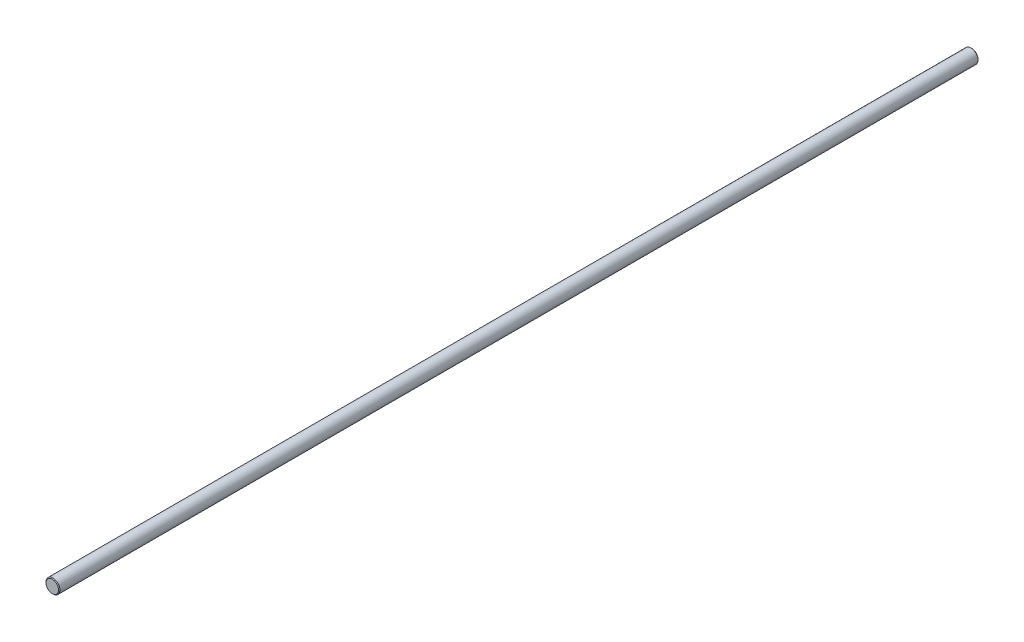
ISO-10303-21;
HEADER;
FILE_DESCRIPTION(('STEP AP214'),'2;1');
FILE_NAME('part.step','',(''),(''),'','','');
FILE_SCHEMA(('AUTOMOTIVE_DESIGN { 1 0 10303 214 1 1 1 1 }'));
ENDSEC;
DATA;
#1=APPLICATION_CONTEXT('core data for automotive mechanical design processes');
#2=APPLICATION_PROTOCOL_DEFINITION('international standard','automotive_design',2000,#1);
#3=PRODUCT_CONTEXT('',#1,'mechanical');
#4=PRODUCT('Part','Part','',(#3));
#5=PRODUCT_RELATED_PRODUCT_CATEGORY('part','',(#4));
#6=PRODUCT_DEFINITION_FORMATION('','',#4);
#7=PRODUCT_DEFINITION_CONTEXT('part definition',#1,'design');
#8=PRODUCT_DEFINITION('design','',#6,#7);
#9=PRODUCT_DEFINITION_SHAPE('','',#8);
#10=(LENGTH_UNIT() NAMED_UNIT(*) SI_UNIT(.MILLI.,.METRE.));
#11=(NAMED_UNIT(*) PLANE_ANGLE_UNIT() SI_UNIT($,.RADIAN.));
#12=(NAMED_UNIT(*) SI_UNIT($,.STERADIAN.) SOLID_ANGLE_UNIT());
#13=UNCERTAINTY_MEASURE_WITH_UNIT(LENGTH_MEASURE(1.E-05),#10,'distance_accuracy_value','');
#14=(GEOMETRIC_REPRESENTATION_CONTEXT(3) GLOBAL_UNCERTAINTY_ASSIGNED_CONTEXT((#13)) GLOBAL_UNIT_ASSIGNED_CONTEXT((#10,
#11,#12)) REPRESENTATION_CONTEXT('',''));
#15=CARTESIAN_POINT('',(0.,0.,0.));
#16=DIRECTION('',(0.,0.,1.));
#17=DIRECTION('',(1.,0.,0.));
#18=AXIS2_PLACEMENT_3D('',#15,#16,#17);
#19=CARTESIAN_POINT('',(0.,0.,528.));
#20=DIRECTION('',(0.,0.,-1.));
#21=DIRECTION('',(-1.,0.,0.));
#22=AXIS2_PLACEMENT_3D('',#19,#20,#21);
#23=CYLINDRICAL_SURFACE('',#22,4.);
#24=CARTESIAN_POINT('',(0.,0.,0.399999999999956));
#25=DIRECTION('',(0.,0.,1.));
#26=DIRECTION('',(1.,0.,0.));
#27=AXIS2_PLACEMENT_3D('',#24,#25,#26);
#28=CIRCLE('',#27,4.);
#29=CARTESIAN_POINT('',(4.,0.,0.399999999999956));
#30=VERTEX_POINT('',#29);
#31=EDGE_CURVE('E53',#30,#30,#28,.T.);
#32=ORIENTED_EDGE('',*,*,#31,.T.);
#33=EDGE_LOOP('',(#32));
#34=FACE_BOUND('',#33,.T.);
#35=CARTESIAN_POINT('',(0.,0.,527.6));
#36=DIRECTION('',(0.,0.,1.));
#37=DIRECTION('',(1.,0.,0.));
#38=AXIS2_PLACEMENT_3D('',#35,#36,#37);
#39=CIRCLE('',#38,4.);
#40=CARTESIAN_POINT('',(4.,0.,527.6));
#41=VERTEX_POINT('',#40);
#42=EDGE_CURVE('E57',#41,#41,#39,.F.);
#43=ORIENTED_EDGE('',*,*,#42,.T.);
#44=EDGE_LOOP('',(#43));
#45=FACE_BOUND('',#44,.T.);
#46=ADVANCED_FACE('F42',(#34,#45),#23,.T.);
#47=CARTESIAN_POINT('',(0.,0.,528.));
#48=DIRECTION('',(0.,0.,1.));
#49=DIRECTION('',(1.,0.,0.));
#50=AXIS2_PLACEMENT_3D('',#47,#48,#49);
#51=PLANE('',#50);
#52=CARTESIAN_POINT('',(0.,0.,528.));
#53=DIRECTION('',(0.,0.,1.));
#54=DIRECTION('',(1.,0.,0.));
#55=AXIS2_PLACEMENT_3D('',#52,#53,#54);
#56=CIRCLE('',#55,3.6000000000001);
#57=CARTESIAN_POINT('',(3.6000000000001,0.,528.));
#58=VERTEX_POINT('',#57);
#59=EDGE_CURVE('E12',#58,#58,#56,.T.);
#60=ORIENTED_EDGE('',*,*,#59,.T.);
#61=EDGE_LOOP('',(#60));
#62=FACE_BOUND('',#61,.T.);
#63=ADVANCED_FACE('F73',(#62),#51,.T.);
#64=CARTESIAN_POINT('',(0.,0.,0.));
#65=DIRECTION('',(0.,0.,1.));
#66=DIRECTION('',(1.,0.,0.));
#67=AXIS2_PLACEMENT_3D('',#64,#65,#66);
#68=PLANE('',#67);
#69=CARTESIAN_POINT('',(0.,0.,0.));
#70=DIRECTION('',(0.,0.,1.));
#71=DIRECTION('',(1.,0.,0.));
#72=AXIS2_PLACEMENT_3D('',#69,#70,#71);
#73=CIRCLE('',#72,3.59999999999999);
#74=CARTESIAN_POINT('',(3.59999999999999,0.,0.));
#75=VERTEX_POINT('',#74);
#76=EDGE_CURVE('E49',#75,#75,#73,.F.);
#77=ORIENTED_EDGE('',*,*,#76,.T.);
#78=EDGE_LOOP('',(#77));
#79=FACE_BOUND('',#78,.T.);
#80=ADVANCED_FACE('F70',(#79),#68,.F.);
#81=CARTESIAN_POINT('',(0.,0.,0.399999999999956));
#82=DIRECTION('',(0.,0.,1.));
#83=DIRECTION('',(1.,0.,0.));
#84=AXIS2_PLACEMENT_3D('',#81,#82,#83);
#85=CONICAL_SURFACE('',#84,4.,0.785398163397513);
#86=ORIENTED_EDGE('',*,*,#76,.F.);
#87=EDGE_LOOP('',(#86));
#88=FACE_BOUND('',#87,.T.);
#89=ORIENTED_EDGE('',*,*,#31,.F.);
#90=EDGE_LOOP('',(#89));
#91=FACE_BOUND('',#90,.T.);
#92=ADVANCED_FACE('F66',(#88,#91),#85,.T.);
#93=CARTESIAN_POINT('',(0.,0.,528.));
#94=DIRECTION('',(0.,0.,-1.));
#95=DIRECTION('',(-1.,0.,0.));
#96=AXIS2_PLACEMENT_3D('',#93,#94,#95);
#97=CONICAL_SURFACE('',#96,3.6000000000001,0.785398163397513);
#98=ORIENTED_EDGE('',*,*,#42,.F.);
#99=EDGE_LOOP('',(#98));
#100=FACE_BOUND('',#99,.T.);
#101=ORIENTED_EDGE('',*,*,#59,.F.);
#102=EDGE_LOOP('',(#101));
#103=FACE_BOUND('',#102,.T.);
#104=ADVANCED_FACE('F44',(#100,#103),#97,.T.);
#105=CLOSED_SHELL('',(#46,#63,#80,#92,#104));
#106=MANIFOLD_SOLID_BREP('B2',#105);
#107=ADVANCED_BREP_SHAPE_REPRESENTATION('',(#18,#106),#14);
#108=SHAPE_DEFINITION_REPRESENTATION(#9,#107);
ENDSEC;
END-ISO-10303-21;
